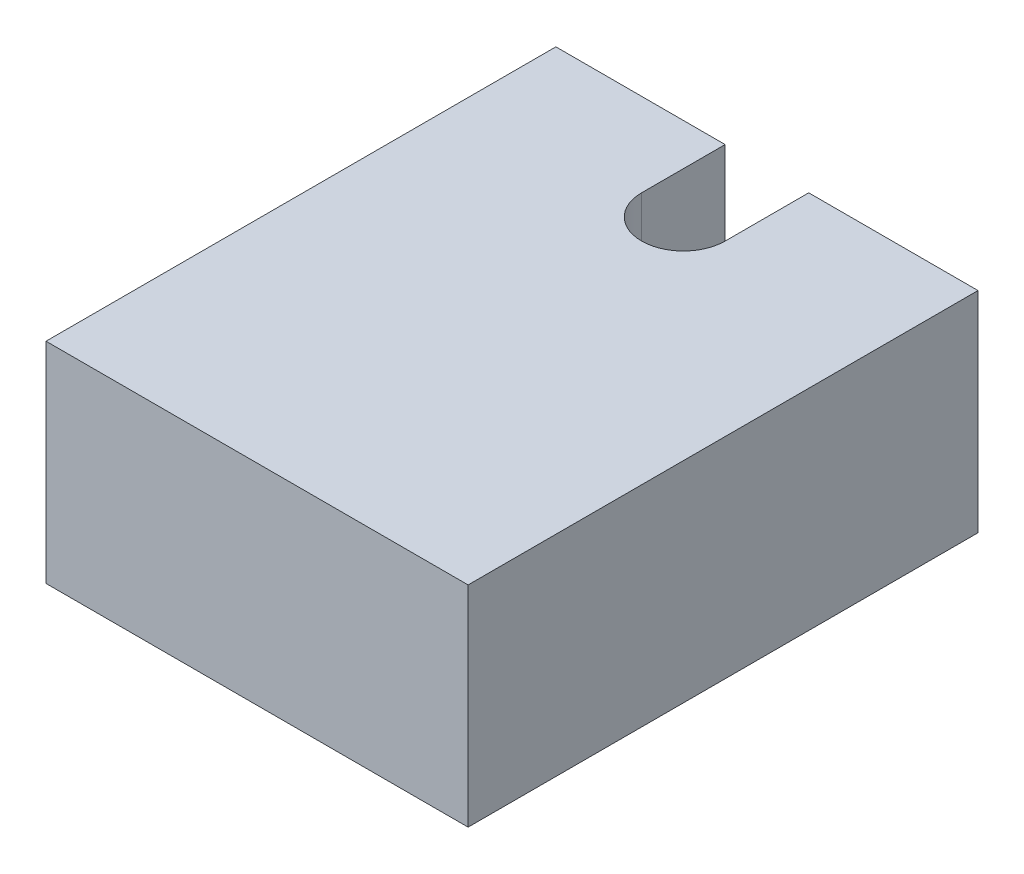
ISO-10303-21;
HEADER;
FILE_DESCRIPTION(('STEP AP214'),'2;1');
FILE_NAME('part.step','',(''),(''),'','','');
FILE_SCHEMA(('AUTOMOTIVE_DESIGN { 1 0 10303 214 1 1 1 1 }'));
ENDSEC;
DATA;
#1=APPLICATION_CONTEXT('core data for automotive mechanical design processes');
#2=APPLICATION_PROTOCOL_DEFINITION('international standard','automotive_design',2000,#1);
#3=PRODUCT_CONTEXT('',#1,'mechanical');
#4=PRODUCT('Part','Part','',(#3));
#5=PRODUCT_RELATED_PRODUCT_CATEGORY('part','',(#4));
#6=PRODUCT_DEFINITION_FORMATION('','',#4);
#7=PRODUCT_DEFINITION_CONTEXT('part definition',#1,'design');
#8=PRODUCT_DEFINITION('design','',#6,#7);
#9=PRODUCT_DEFINITION_SHAPE('','',#8);
#10=(LENGTH_UNIT() NAMED_UNIT(*) SI_UNIT(.MILLI.,.METRE.));
#11=(NAMED_UNIT(*) PLANE_ANGLE_UNIT() SI_UNIT($,.RADIAN.));
#12=(NAMED_UNIT(*) SI_UNIT($,.STERADIAN.) SOLID_ANGLE_UNIT());
#13=UNCERTAINTY_MEASURE_WITH_UNIT(LENGTH_MEASURE(1.E-05),#10,'distance_accuracy_value','');
#14=(GEOMETRIC_REPRESENTATION_CONTEXT(3) GLOBAL_UNCERTAINTY_ASSIGNED_CONTEXT((#13)) GLOBAL_UNIT_ASSIGNED_CONTEXT((#10,
#11,#12)) REPRESENTATION_CONTEXT('',''));
#15=CARTESIAN_POINT('',(0.,0.,0.));
#16=DIRECTION('',(0.,0.,1.));
#17=DIRECTION('',(1.,0.,0.));
#18=AXIS2_PLACEMENT_3D('',#15,#16,#17);
#19=CARTESIAN_POINT('',(2.025,2.51,-6.1));
#20=DIRECTION('',(-1.,0.,0.));
#21=DIRECTION('',(0.,0.,1.));
#22=AXIS2_PLACEMENT_3D('',#19,#20,#21);
#23=PLANE('',#22);
#24=DIRECTION('',(0.,0.,-1.));
#25=VECTOR('',#24,1.);
#26=CARTESIAN_POINT('',(2.025,0.,-6.1));
#27=LINE('',#26,#25);
#28=CARTESIAN_POINT('',(2.025,0.,-5.1));
#29=VERTEX_POINT('',#28);
#30=CARTESIAN_POINT('',(2.025,0.,-6.1));
#31=VERTEX_POINT('',#30);
#32=EDGE_CURVE('E97',#29,#31,#27,.T.);
#33=ORIENTED_EDGE('',*,*,#32,.T.);
#34=DIRECTION('',(0.,-1.,0.));
#35=VECTOR('',#34,1.);
#36=CARTESIAN_POINT('',(2.025,2.51,-6.1));
#37=LINE('',#36,#35);
#38=CARTESIAN_POINT('',(2.025,2.51,-6.1));
#39=VERTEX_POINT('',#38);
#40=EDGE_CURVE('E115',#39,#31,#37,.T.);
#41=ORIENTED_EDGE('',*,*,#40,.F.);
#42=DIRECTION('',(0.,0.,-1.));
#43=VECTOR('',#42,1.);
#44=CARTESIAN_POINT('',(2.025,2.51,-6.1));
#45=LINE('',#44,#43);
#46=CARTESIAN_POINT('',(2.025,2.51,-5.1));
#47=VERTEX_POINT('',#46);
#48=EDGE_CURVE('E112',#47,#39,#45,.T.);
#49=ORIENTED_EDGE('',*,*,#48,.F.);
#50=DIRECTION('',(0.,-1.,0.));
#51=VECTOR('',#50,1.);
#52=CARTESIAN_POINT('',(2.025,2.51,-5.1));
#53=LINE('',#52,#51);
#54=EDGE_CURVE('E110',#47,#29,#53,.T.);
#55=ORIENTED_EDGE('',*,*,#54,.T.);
#56=EDGE_LOOP('',(#33,#41,#49,#55));
#57=FACE_BOUND('',#56,.T.);
#58=CARTESIAN_POINT('',(2.025,1.255,-5.6));
#59=DIRECTION('',(-1.,0.,0.));
#60=DIRECTION('',(0.,0.,1.));
#61=AXIS2_PLACEMENT_3D('',#58,#59,#60);
#62=CIRCLE('',#61,0.25);
#63=CARTESIAN_POINT('',(2.025,1.255,-5.35));
#64=VERTEX_POINT('',#63);
#65=EDGE_CURVE('E11',#64,#64,#62,.F.);
#66=ORIENTED_EDGE('',*,*,#65,.F.);
#67=EDGE_LOOP('',(#66));
#68=FACE_BOUND('',#67,.T.);
#69=ADVANCED_FACE('F32',(#57,#68),#23,.F.);
#70=CARTESIAN_POINT('',(3.025,2.51,-5.1));
#71=DIRECTION('',(1.,0.,0.));
#72=DIRECTION('',(0.,0.,-1.));
#73=AXIS2_PLACEMENT_3D('',#70,#71,#72);
#74=PLANE('',#73);
#75=DIRECTION('',(0.,0.,1.));
#76=VECTOR('',#75,1.);
#77=CARTESIAN_POINT('',(3.025,0.,-5.1));
#78=LINE('',#77,#76);
#79=CARTESIAN_POINT('',(3.025,0.,-6.1));
#80=VERTEX_POINT('',#79);
#81=CARTESIAN_POINT('',(3.025,0.,-5.1));
#82=VERTEX_POINT('',#81);
#83=EDGE_CURVE('E130',#80,#82,#78,.T.);
#84=ORIENTED_EDGE('',*,*,#83,.T.);
#85=DIRECTION('',(0.,-1.,0.));
#86=VECTOR('',#85,1.);
#87=CARTESIAN_POINT('',(3.025,2.51,-5.1));
#88=LINE('',#87,#86);
#89=CARTESIAN_POINT('',(3.025,2.51,-5.1));
#90=VERTEX_POINT('',#89);
#91=EDGE_CURVE('E118',#90,#82,#88,.T.);
#92=ORIENTED_EDGE('',*,*,#91,.F.);
#93=DIRECTION('',(0.,0.,1.));
#94=VECTOR('',#93,1.);
#95=CARTESIAN_POINT('',(3.025,2.51,-5.1));
#96=LINE('',#95,#94);
#97=CARTESIAN_POINT('',(3.025,2.51,-6.1));
#98=VERTEX_POINT('',#97);
#99=EDGE_CURVE('E47',#98,#90,#96,.T.);
#100=ORIENTED_EDGE('',*,*,#99,.F.);
#101=DIRECTION('',(0.,-1.,0.));
#102=VECTOR('',#101,1.);
#103=CARTESIAN_POINT('',(3.025,2.51,-6.1));
#104=LINE('',#103,#102);
#105=EDGE_CURVE('E146',#98,#80,#104,.T.);
#106=ORIENTED_EDGE('',*,*,#105,.T.);
#107=EDGE_LOOP('',(#84,#92,#100,#106));
#108=FACE_BOUND('',#107,.T.);
#109=CARTESIAN_POINT('',(3.025,1.255,-5.6));
#110=DIRECTION('',(1.,0.,0.));
#111=DIRECTION('',(0.,0.,-1.));
#112=AXIS2_PLACEMENT_3D('',#109,#110,#111);
#113=CIRCLE('',#112,0.25);
#114=CARTESIAN_POINT('',(3.025,1.255,-5.85));
#115=VERTEX_POINT('',#114);
#116=EDGE_CURVE('E40',#115,#115,#113,.F.);
#117=ORIENTED_EDGE('',*,*,#116,.F.);
#118=EDGE_LOOP('',(#117));
#119=FACE_BOUND('',#118,.T.);
#120=ADVANCED_FACE('F167',(#108,#119),#74,.F.);
#121=CARTESIAN_POINT('',(2.525,2.51,-5.1));
#122=DIRECTION('',(0.,-1.,0.));
#123=DIRECTION('',(0.,0.,-1.));
#124=AXIS2_PLACEMENT_3D('',#121,#122,#123);
#125=CYLINDRICAL_SURFACE('',#124,0.5);
#126=CARTESIAN_POINT('',(2.525,0.,-5.1));
#127=DIRECTION('',(0.,-1.,0.));
#128=DIRECTION('',(0.,0.,1.));
#129=AXIS2_PLACEMENT_3D('',#126,#127,#128);
#130=CIRCLE('',#129,0.5);
#131=EDGE_CURVE('E102',#82,#29,#130,.T.);
#132=ORIENTED_EDGE('',*,*,#131,.T.);
#133=ORIENTED_EDGE('',*,*,#54,.F.);
#134=CARTESIAN_POINT('',(2.525,2.51,-5.1));
#135=DIRECTION('',(0.,-1.,0.));
#136=DIRECTION('',(0.,0.,1.));
#137=AXIS2_PLACEMENT_3D('',#134,#135,#136);
#138=CIRCLE('',#137,0.5);
#139=EDGE_CURVE('E132',#90,#47,#138,.T.);
#140=ORIENTED_EDGE('',*,*,#139,.F.);
#141=ORIENTED_EDGE('',*,*,#91,.T.);
#142=EDGE_LOOP('',(#132,#133,#140,#141));
#143=FACE_BOUND('',#142,.T.);
#144=ADVANCED_FACE('F34',(#143),#125,.F.);
#145=CARTESIAN_POINT('',(0.,2.51,-6.1));
#146=DIRECTION('',(0.,0.,1.));
#147=DIRECTION('',(1.,0.,0.));
#148=AXIS2_PLACEMENT_3D('',#145,#146,#147);
#149=PLANE('',#148);
#150=DIRECTION('',(-1.,0.,0.));
#151=VECTOR('',#150,1.);
#152=CARTESIAN_POINT('',(0.,0.,-6.1));
#153=LINE('',#152,#151);
#154=CARTESIAN_POINT('',(0.,0.,-6.1));
#155=VERTEX_POINT('',#154);
#156=EDGE_CURVE('E104',#31,#155,#153,.T.);
#157=ORIENTED_EDGE('',*,*,#156,.T.);
#158=DIRECTION('',(0.,-1.,0.));
#159=VECTOR('',#158,1.);
#160=CARTESIAN_POINT('',(0.,2.51,-6.1));
#161=LINE('',#160,#159);
#162=CARTESIAN_POINT('',(0.,2.51,-6.1));
#163=VERTEX_POINT('',#162);
#164=EDGE_CURVE('E158',#163,#155,#161,.T.);
#165=ORIENTED_EDGE('',*,*,#164,.F.);
#166=DIRECTION('',(-1.,0.,0.));
#167=VECTOR('',#166,1.);
#168=CARTESIAN_POINT('',(0.,2.51,-6.1));
#169=LINE('',#168,#167);
#170=EDGE_CURVE('E135',#39,#163,#169,.T.);
#171=ORIENTED_EDGE('',*,*,#170,.F.);
#172=ORIENTED_EDGE('',*,*,#40,.T.);
#173=EDGE_LOOP('',(#157,#165,#171,#172));
#174=FACE_BOUND('',#173,.T.);
#175=ADVANCED_FACE('F175',(#174),#149,.F.);
#176=CARTESIAN_POINT('',(0.,2.51,0.));
#177=DIRECTION('',(1.,0.,0.));
#178=DIRECTION('',(0.,0.,-1.));
#179=AXIS2_PLACEMENT_3D('',#176,#177,#178);
#180=PLANE('',#179);
#181=DIRECTION('',(0.,0.,1.));
#182=VECTOR('',#181,1.);
#183=CARTESIAN_POINT('',(0.,0.,0.));
#184=LINE('',#183,#182);
#185=CARTESIAN_POINT('',(0.,0.,0.));
#186=VERTEX_POINT('',#185);
#187=EDGE_CURVE('E122',#155,#186,#184,.T.);
#188=ORIENTED_EDGE('',*,*,#187,.T.);
#189=DIRECTION('',(0.,-1.,0.));
#190=VECTOR('',#189,1.);
#191=CARTESIAN_POINT('',(0.,2.51,0.));
#192=LINE('',#191,#190);
#193=CARTESIAN_POINT('',(0.,2.51,0.));
#194=VERTEX_POINT('',#193);
#195=EDGE_CURVE('E155',#194,#186,#192,.T.);
#196=ORIENTED_EDGE('',*,*,#195,.F.);
#197=DIRECTION('',(0.,0.,1.));
#198=VECTOR('',#197,1.);
#199=CARTESIAN_POINT('',(0.,2.51,0.));
#200=LINE('',#199,#198);
#201=EDGE_CURVE('E137',#163,#194,#200,.T.);
#202=ORIENTED_EDGE('',*,*,#201,.F.);
#203=ORIENTED_EDGE('',*,*,#164,.T.);
#204=EDGE_LOOP('',(#188,#196,#202,#203));
#205=FACE_BOUND('',#204,.T.);
#206=ADVANCED_FACE('F191',(#205),#180,.F.);
#207=CARTESIAN_POINT('',(5.05,2.51,0.));
#208=DIRECTION('',(0.,0.,-1.));
#209=DIRECTION('',(-1.,0.,0.));
#210=AXIS2_PLACEMENT_3D('',#207,#208,#209);
#211=PLANE('',#210);
#212=DIRECTION('',(1.,0.,0.));
#213=VECTOR('',#212,1.);
#214=CARTESIAN_POINT('',(5.05,0.,0.));
#215=LINE('',#214,#213);
#216=CARTESIAN_POINT('',(5.05,0.,0.));
#217=VERTEX_POINT('',#216);
#218=EDGE_CURVE('E124',#186,#217,#215,.T.);
#219=ORIENTED_EDGE('',*,*,#218,.T.);
#220=DIRECTION('',(0.,-1.,0.));
#221=VECTOR('',#220,1.);
#222=CARTESIAN_POINT('',(5.05,2.51,0.));
#223=LINE('',#222,#221);
#224=CARTESIAN_POINT('',(5.05,2.51,0.));
#225=VERTEX_POINT('',#224);
#226=EDGE_CURVE('E152',#225,#217,#223,.T.);
#227=ORIENTED_EDGE('',*,*,#226,.F.);
#228=DIRECTION('',(1.,0.,0.));
#229=VECTOR('',#228,1.);
#230=CARTESIAN_POINT('',(5.05,2.51,0.));
#231=LINE('',#230,#229);
#232=EDGE_CURVE('E139',#194,#225,#231,.T.);
#233=ORIENTED_EDGE('',*,*,#232,.F.);
#234=ORIENTED_EDGE('',*,*,#195,.T.);
#235=EDGE_LOOP('',(#219,#227,#233,#234));
#236=FACE_BOUND('',#235,.T.);
#237=ADVANCED_FACE('F187',(#236),#211,.F.);
#238=CARTESIAN_POINT('',(5.05,2.51,-6.1));
#239=DIRECTION('',(-1.,0.,0.));
#240=DIRECTION('',(0.,0.,1.));
#241=AXIS2_PLACEMENT_3D('',#238,#239,#240);
#242=PLANE('',#241);
#243=DIRECTION('',(0.,0.,-1.));
#244=VECTOR('',#243,1.);
#245=CARTESIAN_POINT('',(5.05,0.,-6.1));
#246=LINE('',#245,#244);
#247=CARTESIAN_POINT('',(5.05,0.,-6.1));
#248=VERTEX_POINT('',#247);
#249=EDGE_CURVE('E126',#217,#248,#246,.T.);
#250=ORIENTED_EDGE('',*,*,#249,.T.);
#251=DIRECTION('',(0.,-1.,0.));
#252=VECTOR('',#251,1.);
#253=CARTESIAN_POINT('',(5.05,2.51,-6.1));
#254=LINE('',#253,#252);
#255=CARTESIAN_POINT('',(5.05,2.51,-6.1));
#256=VERTEX_POINT('',#255);
#257=EDGE_CURVE('E149',#256,#248,#254,.T.);
#258=ORIENTED_EDGE('',*,*,#257,.F.);
#259=DIRECTION('',(0.,0.,-1.));
#260=VECTOR('',#259,1.);
#261=CARTESIAN_POINT('',(5.05,2.51,-6.1));
#262=LINE('',#261,#260);
#263=EDGE_CURVE('E141',#225,#256,#262,.T.);
#264=ORIENTED_EDGE('',*,*,#263,.F.);
#265=ORIENTED_EDGE('',*,*,#226,.T.);
#266=EDGE_LOOP('',(#250,#258,#264,#265));
#267=FACE_BOUND('',#266,.T.);
#268=ADVANCED_FACE('F183',(#267),#242,.F.);
#269=CARTESIAN_POINT('',(3.025,2.51,-6.1));
#270=DIRECTION('',(0.,0.,1.));
#271=DIRECTION('',(1.,0.,0.));
#272=AXIS2_PLACEMENT_3D('',#269,#270,#271);
#273=PLANE('',#272);
#274=DIRECTION('',(-1.,0.,0.));
#275=VECTOR('',#274,1.);
#276=CARTESIAN_POINT('',(3.025,0.,-6.1));
#277=LINE('',#276,#275);
#278=EDGE_CURVE('E128',#248,#80,#277,.T.);
#279=ORIENTED_EDGE('',*,*,#278,.T.);
#280=ORIENTED_EDGE('',*,*,#105,.F.);
#281=DIRECTION('',(-1.,0.,0.));
#282=VECTOR('',#281,1.);
#283=CARTESIAN_POINT('',(3.025,2.51,-6.1));
#284=LINE('',#283,#282);
#285=EDGE_CURVE('E52',#256,#98,#284,.T.);
#286=ORIENTED_EDGE('',*,*,#285,.F.);
#287=ORIENTED_EDGE('',*,*,#257,.T.);
#288=EDGE_LOOP('',(#279,#280,#286,#287));
#289=FACE_BOUND('',#288,.T.);
#290=ADVANCED_FACE('F180',(#289),#273,.F.);
#291=CARTESIAN_POINT('',(2.525,2.51,-5.1));
#292=DIRECTION('',(0.,1.,0.));
#293=DIRECTION('',(0.,0.,1.));
#294=AXIS2_PLACEMENT_3D('',#291,#292,#293);
#295=PLANE('',#294);
#296=ORIENTED_EDGE('',*,*,#139,.T.);
#297=ORIENTED_EDGE('',*,*,#48,.T.);
#298=ORIENTED_EDGE('',*,*,#170,.T.);
#299=ORIENTED_EDGE('',*,*,#201,.T.);
#300=ORIENTED_EDGE('',*,*,#232,.T.);
#301=ORIENTED_EDGE('',*,*,#263,.T.);
#302=ORIENTED_EDGE('',*,*,#285,.T.);
#303=ORIENTED_EDGE('',*,*,#99,.T.);
#304=EDGE_LOOP('',(#296,#297,#298,#299,#300,#301,#302,#303));
#305=FACE_BOUND('',#304,.T.);
#306=ADVANCED_FACE('F178',(#305),#295,.T.);
#307=CARTESIAN_POINT('',(2.525,0.,-5.1));
#308=DIRECTION('',(0.,1.,0.));
#309=DIRECTION('',(0.,0.,1.));
#310=AXIS2_PLACEMENT_3D('',#307,#308,#309);
#311=PLANE('',#310);
#312=ORIENTED_EDGE('',*,*,#131,.F.);
#313=ORIENTED_EDGE('',*,*,#83,.F.);
#314=ORIENTED_EDGE('',*,*,#278,.F.);
#315=ORIENTED_EDGE('',*,*,#249,.F.);
#316=ORIENTED_EDGE('',*,*,#218,.F.);
#317=ORIENTED_EDGE('',*,*,#187,.F.);
#318=ORIENTED_EDGE('',*,*,#156,.F.);
#319=ORIENTED_EDGE('',*,*,#32,.F.);
#320=EDGE_LOOP('',(#312,#313,#314,#315,#316,#317,#318,#319));
#321=FACE_BOUND('',#320,.T.);
#322=ADVANCED_FACE('F99',(#321),#311,.F.);
#323=CARTESIAN_POINT('',(3.025,1.255,-5.6));
#324=DIRECTION('',(-1.,0.,0.));
#325=DIRECTION('',(0.,0.,1.));
#326=AXIS2_PLACEMENT_3D('',#323,#324,#325);
#327=CYLINDRICAL_SURFACE('',#326,0.25);
#328=ORIENTED_EDGE('',*,*,#116,.T.);
#329=EDGE_LOOP('',(#328));
#330=FACE_BOUND('',#329,.T.);
#331=ORIENTED_EDGE('',*,*,#65,.T.);
#332=EDGE_LOOP('',(#331));
#333=FACE_BOUND('',#332,.T.);
#334=ADVANCED_FACE('F164',(#330,#333),#327,.T.);
#335=CLOSED_SHELL('',(#69,#120,#144,#175,#206,#237,#268,#290,#306,#322,#334));
#336=MANIFOLD_SOLID_BREP('B2',#335);
#337=ADVANCED_BREP_SHAPE_REPRESENTATION('',(#18,#336),#14);
#338=SHAPE_DEFINITION_REPRESENTATION(#9,#337);
ENDSEC;
END-ISO-10303-21;
